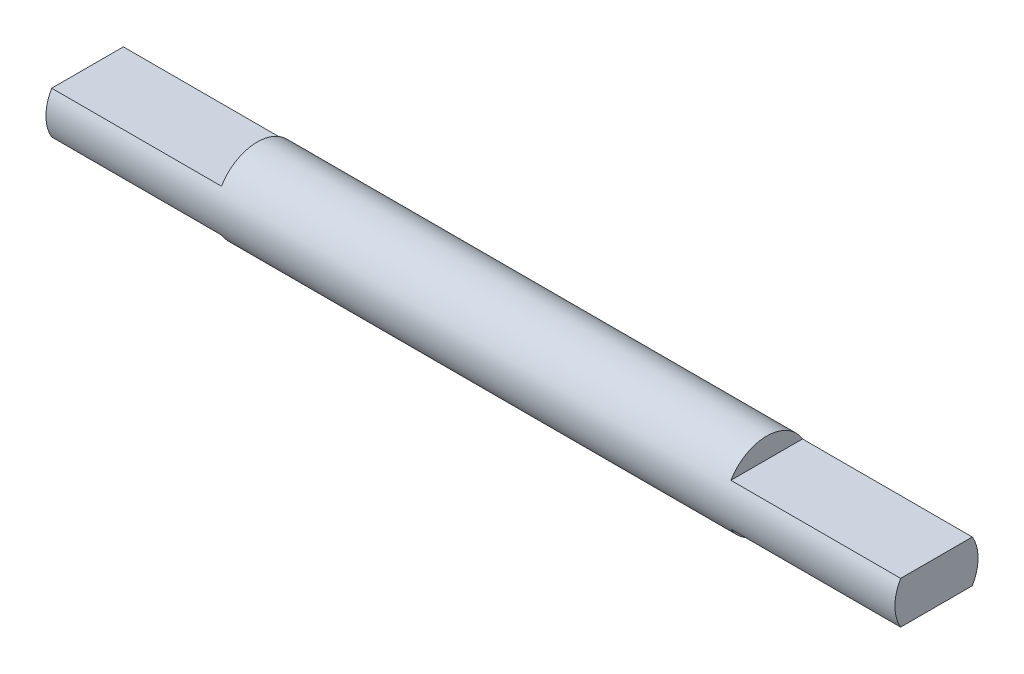
ISO-10303-21;
HEADER;
FILE_DESCRIPTION(('STEP AP214'),'2;1');
FILE_NAME('part.step','',(''),(''),'','','');
FILE_SCHEMA(('AUTOMOTIVE_DESIGN { 1 0 10303 214 1 1 1 1 }'));
ENDSEC;
DATA;
#1=APPLICATION_CONTEXT('core data for automotive mechanical design processes');
#2=APPLICATION_PROTOCOL_DEFINITION('international standard','automotive_design',2000,#1);
#3=PRODUCT_CONTEXT('',#1,'mechanical');
#4=PRODUCT('Part','Part','',(#3));
#5=PRODUCT_RELATED_PRODUCT_CATEGORY('part','',(#4));
#6=PRODUCT_DEFINITION_FORMATION('','',#4);
#7=PRODUCT_DEFINITION_CONTEXT('part definition',#1,'design');
#8=PRODUCT_DEFINITION('design','',#6,#7);
#9=PRODUCT_DEFINITION_SHAPE('','',#8);
#10=(LENGTH_UNIT() NAMED_UNIT(*) SI_UNIT(.MILLI.,.METRE.));
#11=(NAMED_UNIT(*) PLANE_ANGLE_UNIT() SI_UNIT($,.RADIAN.));
#12=(NAMED_UNIT(*) SI_UNIT($,.STERADIAN.) SOLID_ANGLE_UNIT());
#13=UNCERTAINTY_MEASURE_WITH_UNIT(LENGTH_MEASURE(1.E-05),#10,'distance_accuracy_value','');
#14=(GEOMETRIC_REPRESENTATION_CONTEXT(3) GLOBAL_UNCERTAINTY_ASSIGNED_CONTEXT((#13)) GLOBAL_UNIT_ASSIGNED_CONTEXT((#10,
#11,#12)) REPRESENTATION_CONTEXT('',''));
#15=CARTESIAN_POINT('',(0.,0.,0.));
#16=DIRECTION('',(0.,0.,1.));
#17=DIRECTION('',(1.,0.,0.));
#18=AXIS2_PLACEMENT_3D('',#15,#16,#17);
#19=CARTESIAN_POINT('',(50.,0.,0.));
#20=DIRECTION('',(-1.,0.,0.));
#21=DIRECTION('',(0.,0.,1.));
#22=AXIS2_PLACEMENT_3D('',#19,#20,#21);
#23=CYLINDRICAL_SURFACE('',#22,2.45);
#24=CARTESIAN_POINT('',(50.,0.,0.));
#25=DIRECTION('',(1.,0.,0.));
#26=DIRECTION('',(0.,0.,-1.));
#27=AXIS2_PLACEMENT_3D('',#24,#25,#26);
#28=CIRCLE('',#27,2.45);
#29=CARTESIAN_POINT('',(50.,-1.245,-2.1100888606881));
#30=VERTEX_POINT('',#29);
#31=CARTESIAN_POINT('',(50.,1.245,-2.1100888606881));
#32=VERTEX_POINT('',#31);
#33=EDGE_CURVE('E43',#30,#32,#28,.T.);
#34=ORIENTED_EDGE('',*,*,#33,.F.);
#35=DIRECTION('',(1.,0.,0.));
#36=VECTOR('',#35,1.);
#37=CARTESIAN_POINT('',(40.,-1.245,-2.1100888606881));
#38=LINE('',#37,#36);
#39=CARTESIAN_POINT('',(40.,-1.245,-2.1100888606881));
#40=VERTEX_POINT('',#39);
#41=EDGE_CURVE('E135',#40,#30,#38,.T.);
#42=ORIENTED_EDGE('',*,*,#41,.F.);
#43=CARTESIAN_POINT('',(40.,0.,0.));
#44=DIRECTION('',(1.,0.,0.));
#45=DIRECTION('',(0.,0.,-1.));
#46=AXIS2_PLACEMENT_3D('',#43,#44,#45);
#47=CIRCLE('',#46,2.45);
#48=CARTESIAN_POINT('',(40.,-1.245,2.1100888606881));
#49=VERTEX_POINT('',#48);
#50=EDGE_CURVE('E130',#49,#40,#47,.T.);
#51=ORIENTED_EDGE('',*,*,#50,.F.);
#52=DIRECTION('',(1.,0.,0.));
#53=VECTOR('',#52,1.);
#54=CARTESIAN_POINT('',(40.,-1.245,2.1100888606881));
#55=LINE('',#54,#53);
#56=CARTESIAN_POINT('',(50.,-1.245,2.1100888606881));
#57=VERTEX_POINT('',#56);
#58=EDGE_CURVE('E137',#49,#57,#55,.T.);
#59=ORIENTED_EDGE('',*,*,#58,.T.);
#60=CARTESIAN_POINT('',(50.,1.245,2.1100888606881));
#61=VERTEX_POINT('',#60);
#62=EDGE_CURVE('E11',#61,#57,#28,.T.);
#63=ORIENTED_EDGE('',*,*,#62,.F.);
#64=DIRECTION('',(1.,0.,0.));
#65=VECTOR('',#64,1.);
#66=CARTESIAN_POINT('',(40.,1.245,2.1100888606881));
#67=LINE('',#66,#65);
#68=CARTESIAN_POINT('',(40.,1.245,2.1100888606881));
#69=VERTEX_POINT('',#68);
#70=EDGE_CURVE('E147',#69,#61,#67,.T.);
#71=ORIENTED_EDGE('',*,*,#70,.F.);
#72=CARTESIAN_POINT('',(40.,0.,0.));
#73=DIRECTION('',(1.,0.,0.));
#74=DIRECTION('',(0.,0.,1.));
#75=AXIS2_PLACEMENT_3D('',#72,#73,#74);
#76=CIRCLE('',#75,2.45);
#77=CARTESIAN_POINT('',(40.,1.245,-2.1100888606881));
#78=VERTEX_POINT('',#77);
#79=EDGE_CURVE('E142',#78,#69,#76,.T.);
#80=ORIENTED_EDGE('',*,*,#79,.F.);
#81=DIRECTION('',(1.,0.,0.));
#82=VECTOR('',#81,1.);
#83=CARTESIAN_POINT('',(40.,1.245,-2.1100888606881));
#84=LINE('',#83,#82);
#85=EDGE_CURVE('E150',#78,#32,#84,.T.);
#86=ORIENTED_EDGE('',*,*,#85,.T.);
#87=EDGE_LOOP('',(#34,#42,#51,#59,#63,#71,#80,#86));
#88=FACE_BOUND('',#87,.T.);
#89=DIRECTION('',(-1.,0.,0.));
#90=VECTOR('',#89,1.);
#91=CARTESIAN_POINT('',(10.,-1.245,2.1100888606881));
#92=LINE('',#91,#90);
#93=CARTESIAN_POINT('',(10.,-1.245,2.1100888606881));
#94=VERTEX_POINT('',#93);
#95=CARTESIAN_POINT('',(0.,-1.245,2.1100888606881));
#96=VERTEX_POINT('',#95);
#97=EDGE_CURVE('E50',#94,#96,#92,.T.);
#98=ORIENTED_EDGE('',*,*,#97,.F.);
#99=CARTESIAN_POINT('',(10.,0.,0.));
#100=DIRECTION('',(1.,0.,0.));
#101=DIRECTION('',(0.,0.,-1.));
#102=AXIS2_PLACEMENT_3D('',#99,#100,#101);
#103=CIRCLE('',#102,2.45);
#104=CARTESIAN_POINT('',(10.,-1.245,-2.1100888606881));
#105=VERTEX_POINT('',#104);
#106=EDGE_CURVE('E105',#94,#105,#103,.T.);
#107=ORIENTED_EDGE('',*,*,#106,.T.);
#108=DIRECTION('',(-1.,0.,0.));
#109=VECTOR('',#108,1.);
#110=CARTESIAN_POINT('',(10.,-1.245,-2.1100888606881));
#111=LINE('',#110,#109);
#112=CARTESIAN_POINT('',(0.,-1.245,-2.1100888606881));
#113=VERTEX_POINT('',#112);
#114=EDGE_CURVE('E107',#105,#113,#111,.T.);
#115=ORIENTED_EDGE('',*,*,#114,.T.);
#116=CARTESIAN_POINT('',(0.,0.,0.));
#117=DIRECTION('',(1.,0.,0.));
#118=DIRECTION('',(0.,0.,-1.));
#119=AXIS2_PLACEMENT_3D('',#116,#117,#118);
#120=CIRCLE('',#119,2.45);
#121=CARTESIAN_POINT('',(0.,1.245,-2.1100888606881));
#122=VERTEX_POINT('',#121);
#123=EDGE_CURVE('E58',#113,#122,#120,.T.);
#124=ORIENTED_EDGE('',*,*,#123,.T.);
#125=DIRECTION('',(-1.,0.,0.));
#126=VECTOR('',#125,1.);
#127=CARTESIAN_POINT('',(10.,1.245,-2.1100888606881));
#128=LINE('',#127,#126);
#129=CARTESIAN_POINT('',(10.,1.245,-2.1100888606881));
#130=VERTEX_POINT('',#129);
#131=EDGE_CURVE('E122',#130,#122,#128,.T.);
#132=ORIENTED_EDGE('',*,*,#131,.F.);
#133=CARTESIAN_POINT('',(10.,0.,0.));
#134=DIRECTION('',(1.,0.,0.));
#135=DIRECTION('',(0.,0.,-1.));
#136=AXIS2_PLACEMENT_3D('',#133,#134,#135);
#137=CIRCLE('',#136,2.45);
#138=CARTESIAN_POINT('',(10.,1.245,2.1100888606881));
#139=VERTEX_POINT('',#138);
#140=EDGE_CURVE('E117',#130,#139,#137,.T.);
#141=ORIENTED_EDGE('',*,*,#140,.T.);
#142=DIRECTION('',(-1.,0.,0.));
#143=VECTOR('',#142,1.);
#144=CARTESIAN_POINT('',(10.,1.245,2.1100888606881));
#145=LINE('',#144,#143);
#146=CARTESIAN_POINT('',(0.,1.245,2.1100888606881));
#147=VERTEX_POINT('',#146);
#148=EDGE_CURVE('E126',#139,#147,#145,.T.);
#149=ORIENTED_EDGE('',*,*,#148,.T.);
#150=EDGE_CURVE('E38',#147,#96,#120,.T.);
#151=ORIENTED_EDGE('',*,*,#150,.T.);
#152=EDGE_LOOP('',(#98,#107,#115,#124,#132,#141,#149,#151));
#153=FACE_BOUND('',#152,.T.);
#154=ADVANCED_FACE('F35',(#88,#153),#23,.T.);
#155=CARTESIAN_POINT('',(0.,0.,0.));
#156=DIRECTION('',(1.,0.,0.));
#157=DIRECTION('',(0.,0.,-1.));
#158=AXIS2_PLACEMENT_3D('',#155,#156,#157);
#159=PLANE('',#158);
#160=DIRECTION('',(0.,0.,1.));
#161=VECTOR('',#160,1.);
#162=CARTESIAN_POINT('',(0.,-1.245,0.));
#163=LINE('',#162,#161);
#164=EDGE_CURVE('E109',#113,#96,#163,.T.);
#165=ORIENTED_EDGE('',*,*,#164,.T.);
#166=ORIENTED_EDGE('',*,*,#150,.F.);
#167=DIRECTION('',(0.,0.,-1.));
#168=VECTOR('',#167,1.);
#169=CARTESIAN_POINT('',(0.,1.245,0.));
#170=LINE('',#169,#168);
#171=EDGE_CURVE('E110',#147,#122,#170,.T.);
#172=ORIENTED_EDGE('',*,*,#171,.T.);
#173=ORIENTED_EDGE('',*,*,#123,.F.);
#174=EDGE_LOOP('',(#165,#166,#172,#173));
#175=FACE_BOUND('',#174,.T.);
#176=ADVANCED_FACE('F185',(#175),#159,.F.);
#177=CARTESIAN_POINT('',(50.,0.,0.));
#178=DIRECTION('',(1.,0.,0.));
#179=DIRECTION('',(0.,0.,-1.));
#180=AXIS2_PLACEMENT_3D('',#177,#178,#179);
#181=PLANE('',#180);
#182=DIRECTION('',(0.,0.,1.));
#183=VECTOR('',#182,1.);
#184=CARTESIAN_POINT('',(50.,-1.245,2.1100888606881));
#185=LINE('',#184,#183);
#186=EDGE_CURVE('E129',#30,#57,#185,.T.);
#187=ORIENTED_EDGE('',*,*,#186,.F.);
#188=ORIENTED_EDGE('',*,*,#33,.T.);
#189=DIRECTION('',(0.,0.,-1.));
#190=VECTOR('',#189,1.);
#191=CARTESIAN_POINT('',(50.,1.245,2.1100888606881));
#192=LINE('',#191,#190);
#193=EDGE_CURVE('E140',#61,#32,#192,.T.);
#194=ORIENTED_EDGE('',*,*,#193,.F.);
#195=ORIENTED_EDGE('',*,*,#62,.T.);
#196=EDGE_LOOP('',(#187,#188,#194,#195));
#197=FACE_BOUND('',#196,.T.);
#198=ADVANCED_FACE('F163',(#197),#181,.T.);
#199=CARTESIAN_POINT('',(40.,1.245,2.1100888606881));
#200=DIRECTION('',(0.,-1.,0.));
#201=DIRECTION('',(0.,0.,-1.));
#202=AXIS2_PLACEMENT_3D('',#199,#200,#201);
#203=PLANE('',#202);
#204=ORIENTED_EDGE('',*,*,#193,.T.);
#205=ORIENTED_EDGE('',*,*,#85,.F.);
#206=DIRECTION('',(0.,0.,-1.));
#207=VECTOR('',#206,1.);
#208=CARTESIAN_POINT('',(40.,1.245,2.1100888606881));
#209=LINE('',#208,#207);
#210=EDGE_CURVE('E144',#69,#78,#209,.T.);
#211=ORIENTED_EDGE('',*,*,#210,.F.);
#212=ORIENTED_EDGE('',*,*,#70,.T.);
#213=EDGE_LOOP('',(#204,#205,#211,#212));
#214=FACE_BOUND('',#213,.T.);
#215=ADVANCED_FACE('F157',(#214),#203,.F.);
#216=CARTESIAN_POINT('',(40.,0.,0.));
#217=DIRECTION('',(-1.,0.,0.));
#218=DIRECTION('',(0.,0.,1.));
#219=AXIS2_PLACEMENT_3D('',#216,#217,#218);
#220=PLANE('',#219);
#221=ORIENTED_EDGE('',*,*,#79,.T.);
#222=ORIENTED_EDGE('',*,*,#210,.T.);
#223=EDGE_LOOP('',(#221,#222));
#224=FACE_BOUND('',#223,.T.);
#225=ADVANCED_FACE('F182',(#224),#220,.F.);
#226=CARTESIAN_POINT('',(40.,-1.245,2.1100888606881));
#227=DIRECTION('',(0.,1.,0.));
#228=DIRECTION('',(0.,0.,1.));
#229=AXIS2_PLACEMENT_3D('',#226,#227,#228);
#230=PLANE('',#229);
#231=ORIENTED_EDGE('',*,*,#186,.T.);
#232=ORIENTED_EDGE('',*,*,#58,.F.);
#233=DIRECTION('',(0.,0.,1.));
#234=VECTOR('',#233,1.);
#235=CARTESIAN_POINT('',(40.,-1.245,2.1100888606881));
#236=LINE('',#235,#234);
#237=EDGE_CURVE('E132',#40,#49,#236,.T.);
#238=ORIENTED_EDGE('',*,*,#237,.F.);
#239=ORIENTED_EDGE('',*,*,#41,.T.);
#240=EDGE_LOOP('',(#231,#232,#238,#239));
#241=FACE_BOUND('',#240,.T.);
#242=ADVANCED_FACE('F169',(#241),#230,.F.);
#243=CARTESIAN_POINT('',(40.,0.,0.));
#244=DIRECTION('',(1.,0.,0.));
#245=DIRECTION('',(0.,0.,-1.));
#246=AXIS2_PLACEMENT_3D('',#243,#244,#245);
#247=PLANE('',#246);
#248=ORIENTED_EDGE('',*,*,#50,.T.);
#249=ORIENTED_EDGE('',*,*,#237,.T.);
#250=EDGE_LOOP('',(#248,#249));
#251=FACE_BOUND('',#250,.T.);
#252=ADVANCED_FACE('F171',(#251),#247,.T.);
#253=CARTESIAN_POINT('',(10.,1.245,0.));
#254=DIRECTION('',(0.,1.,0.));
#255=DIRECTION('',(0.,0.,1.));
#256=AXIS2_PLACEMENT_3D('',#253,#254,#255);
#257=PLANE('',#256);
#258=ORIENTED_EDGE('',*,*,#171,.F.);
#259=ORIENTED_EDGE('',*,*,#148,.F.);
#260=DIRECTION('',(0.,0.,-1.));
#261=VECTOR('',#260,1.);
#262=CARTESIAN_POINT('',(10.,1.245,0.));
#263=LINE('',#262,#261);
#264=EDGE_CURVE('E120',#139,#130,#263,.T.);
#265=ORIENTED_EDGE('',*,*,#264,.T.);
#266=ORIENTED_EDGE('',*,*,#131,.T.);
#267=EDGE_LOOP('',(#258,#259,#265,#266));
#268=FACE_BOUND('',#267,.T.);
#269=ADVANCED_FACE('F173',(#268),#257,.T.);
#270=CARTESIAN_POINT('',(10.,0.,0.));
#271=DIRECTION('',(1.,0.,0.));
#272=DIRECTION('',(0.,0.,-1.));
#273=AXIS2_PLACEMENT_3D('',#270,#271,#272);
#274=PLANE('',#273);
#275=ORIENTED_EDGE('',*,*,#140,.F.);
#276=ORIENTED_EDGE('',*,*,#264,.F.);
#277=EDGE_LOOP('',(#275,#276));
#278=FACE_BOUND('',#277,.T.);
#279=ADVANCED_FACE('F179',(#278),#274,.F.);
#280=CARTESIAN_POINT('',(10.,-1.245,0.));
#281=DIRECTION('',(0.,-1.,0.));
#282=DIRECTION('',(0.,0.,-1.));
#283=AXIS2_PLACEMENT_3D('',#280,#281,#282);
#284=PLANE('',#283);
#285=ORIENTED_EDGE('',*,*,#164,.F.);
#286=ORIENTED_EDGE('',*,*,#114,.F.);
#287=DIRECTION('',(0.,0.,1.));
#288=VECTOR('',#287,1.);
#289=CARTESIAN_POINT('',(10.,-1.245,0.));
#290=LINE('',#289,#288);
#291=EDGE_CURVE('E101',#105,#94,#290,.T.);
#292=ORIENTED_EDGE('',*,*,#291,.T.);
#293=ORIENTED_EDGE('',*,*,#97,.T.);
#294=EDGE_LOOP('',(#285,#286,#292,#293));
#295=FACE_BOUND('',#294,.T.);
#296=ADVANCED_FACE('F108',(#295),#284,.T.);
#297=CARTESIAN_POINT('',(10.,0.,0.));
#298=DIRECTION('',(1.,0.,0.));
#299=DIRECTION('',(0.,0.,-1.));
#300=AXIS2_PLACEMENT_3D('',#297,#298,#299);
#301=PLANE('',#300);
#302=ORIENTED_EDGE('',*,*,#106,.F.);
#303=ORIENTED_EDGE('',*,*,#291,.F.);
#304=EDGE_LOOP('',(#302,#303));
#305=FACE_BOUND('',#304,.T.);
#306=ADVANCED_FACE('F103',(#305),#301,.F.);
#307=CLOSED_SHELL('',(#154,#176,#198,#215,#225,#242,#252,#269,#279,#296,#306));
#308=MANIFOLD_SOLID_BREP('B2',#307);
#309=ADVANCED_BREP_SHAPE_REPRESENTATION('',(#18,#308),#14);
#310=SHAPE_DEFINITION_REPRESENTATION(#9,#309);
ENDSEC;
END-ISO-10303-21;
